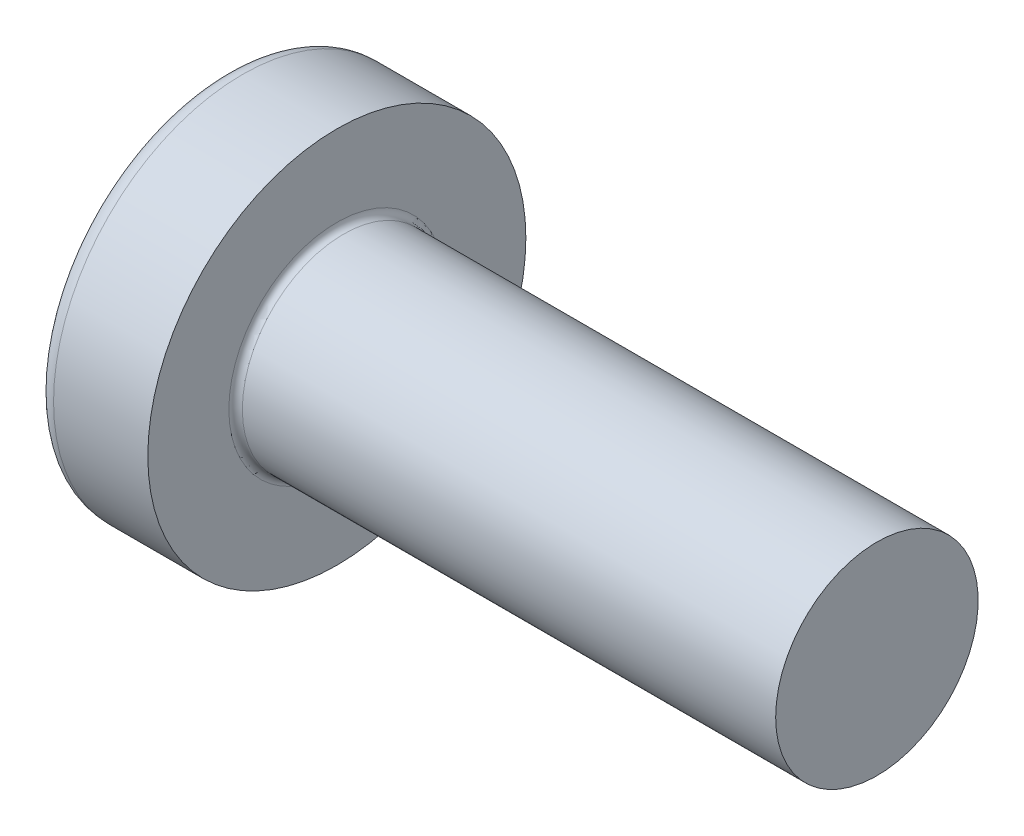
ISO-10303-21;
HEADER;
FILE_DESCRIPTION(('STEP AP214'),'2;1');
FILE_NAME('part.step','',(''),(''),'','','');
FILE_SCHEMA(('AUTOMOTIVE_DESIGN { 1 0 10303 214 1 1 1 1 }'));
ENDSEC;
DATA;
#1=APPLICATION_CONTEXT('core data for automotive mechanical design processes');
#2=APPLICATION_PROTOCOL_DEFINITION('international standard','automotive_design',2000,#1);
#3=PRODUCT_CONTEXT('',#1,'mechanical');
#4=PRODUCT('Part','Part','',(#3));
#5=PRODUCT_RELATED_PRODUCT_CATEGORY('part','',(#4));
#6=PRODUCT_DEFINITION_FORMATION('','',#4);
#7=PRODUCT_DEFINITION_CONTEXT('part definition',#1,'design');
#8=PRODUCT_DEFINITION('design','',#6,#7);
#9=PRODUCT_DEFINITION_SHAPE('','',#8);
#10=(LENGTH_UNIT() NAMED_UNIT(*) SI_UNIT(.MILLI.,.METRE.));
#11=(NAMED_UNIT(*) PLANE_ANGLE_UNIT() SI_UNIT($,.RADIAN.));
#12=(NAMED_UNIT(*) SI_UNIT($,.STERADIAN.) SOLID_ANGLE_UNIT());
#13=UNCERTAINTY_MEASURE_WITH_UNIT(LENGTH_MEASURE(1.E-05),#10,'distance_accuracy_value','');
#14=(GEOMETRIC_REPRESENTATION_CONTEXT(3) GLOBAL_UNCERTAINTY_ASSIGNED_CONTEXT((#13)) GLOBAL_UNIT_ASSIGNED_CONTEXT((#10,
#11,#12)) REPRESENTATION_CONTEXT('',''));
#15=CARTESIAN_POINT('',(0.,0.,0.));
#16=DIRECTION('',(0.,0.,1.));
#17=DIRECTION('',(1.,0.,0.));
#18=AXIS2_PLACEMENT_3D('',#15,#16,#17);
#19=CARTESIAN_POINT('',(-998.069344648895,0.,0.));
#20=DIRECTION('',(-1.,0.,0.));
#21=DIRECTION('',(0.,0.,1.));
#22=AXIS2_PLACEMENT_3D('',#19,#20,#21);
#23=CONICAL_SURFACE('',#22,3077.68353717531,1.25663706143592);
#24=CARTESIAN_POINT('',(1.75,0.,0.));
#25=DIRECTION('',(-1.,0.,0.));
#26=DIRECTION('',(0.,0.,1.));
#27=AXIS2_PLACEMENT_3D('',#24,#25,#26);
#28=CIRCLE('',#27,0.556);
#29=CARTESIAN_POINT('',(1.75,-0.175779377683686,0.52748233181893));
#30=VERTEX_POINT('',#29);
#31=CARTESIAN_POINT('',(1.75,0.175779377683682,0.527482331818932));
#32=VERTEX_POINT('',#31);
#33=EDGE_CURVE('E331',#30,#32,#28,.T.);
#34=ORIENTED_EDGE('',*,*,#33,.T.);
#35=CARTESIAN_POINT('',(1.75,0.,0.));
#36=DIRECTION('',(-1.,0.,0.));
#37=DIRECTION('',(0.,0.,1.));
#38=AXIS2_PLACEMENT_3D('',#35,#36,#37);
#39=CIRCLE('',#38,0.556);
#40=CARTESIAN_POINT('',(1.75,0.369999999999999,0.415013252800439));
#41=VERTEX_POINT('',#40);
#42=EDGE_CURVE('E173',#32,#41,#39,.T.);
#43=ORIENTED_EDGE('',*,*,#42,.T.);
#44=CARTESIAN_POINT('',(1.75,0.,0.));
#45=DIRECTION('',(-1.,0.,0.));
#46=DIRECTION('',(0.,0.,1.));
#47=AXIS2_PLACEMENT_3D('',#44,#45,#46);
#48=CIRCLE('',#47,0.556);
#49=CARTESIAN_POINT('',(1.75,0.415013252800438,0.37));
#50=VERTEX_POINT('',#49);
#51=EDGE_CURVE('E337',#41,#50,#48,.T.);
#52=ORIENTED_EDGE('',*,*,#51,.T.);
#53=CARTESIAN_POINT('',(1.75,0.,0.));
#54=DIRECTION('',(-1.,0.,0.));
#55=DIRECTION('',(0.,0.,1.));
#56=AXIS2_PLACEMENT_3D('',#53,#54,#55);
#57=CIRCLE('',#56,0.556);
#58=CARTESIAN_POINT('',(1.75,0.527482331818932,0.175779377683682));
#59=VERTEX_POINT('',#58);
#60=EDGE_CURVE('E366',#50,#59,#57,.T.);
#61=ORIENTED_EDGE('',*,*,#60,.T.);
#62=CARTESIAN_POINT('',(1.75,0.,0.));
#63=DIRECTION('',(-1.,0.,0.));
#64=DIRECTION('',(0.,0.,1.));
#65=AXIS2_PLACEMENT_3D('',#62,#63,#64);
#66=CIRCLE('',#65,0.556);
#67=CARTESIAN_POINT('',(1.75,0.527482331818932,-0.175779377683682));
#68=VERTEX_POINT('',#67);
#69=EDGE_CURVE('E371',#59,#68,#66,.T.);
#70=ORIENTED_EDGE('',*,*,#69,.T.);
#71=CARTESIAN_POINT('',(1.75,0.,0.));
#72=DIRECTION('',(-1.,0.,0.));
#73=DIRECTION('',(0.,0.,1.));
#74=AXIS2_PLACEMENT_3D('',#71,#72,#73);
#75=CIRCLE('',#74,0.556);
#76=CARTESIAN_POINT('',(1.75,0.415013252800438,-0.37));
#77=VERTEX_POINT('',#76);
#78=EDGE_CURVE('E381',#68,#77,#75,.T.);
#79=ORIENTED_EDGE('',*,*,#78,.T.);
#80=CARTESIAN_POINT('',(1.75,0.,0.));
#81=DIRECTION('',(-1.,0.,0.));
#82=DIRECTION('',(0.,0.,1.));
#83=AXIS2_PLACEMENT_3D('',#80,#81,#82);
#84=CIRCLE('',#83,0.556);
#85=CARTESIAN_POINT('',(1.75,0.370000000000001,-0.415013252800436));
#86=VERTEX_POINT('',#85);
#87=EDGE_CURVE('E323',#77,#86,#84,.T.);
#88=ORIENTED_EDGE('',*,*,#87,.T.);
#89=CARTESIAN_POINT('',(1.75,0.,0.));
#90=DIRECTION('',(-1.,0.,0.));
#91=DIRECTION('',(0.,0.,1.));
#92=AXIS2_PLACEMENT_3D('',#89,#90,#91);
#93=CIRCLE('',#92,0.556);
#94=CARTESIAN_POINT('',(1.75,0.175779377683684,-0.527482331818931));
#95=VERTEX_POINT('',#94);
#96=EDGE_CURVE('E320',#86,#95,#93,.T.);
#97=ORIENTED_EDGE('',*,*,#96,.T.);
#98=CARTESIAN_POINT('',(1.75,0.,0.));
#99=DIRECTION('',(-1.,0.,0.));
#100=DIRECTION('',(0.,0.,1.));
#101=AXIS2_PLACEMENT_3D('',#98,#99,#100);
#102=CIRCLE('',#101,0.556);
#103=CARTESIAN_POINT('',(1.75,-0.17577937768368,-0.527482331818932));
#104=VERTEX_POINT('',#103);
#105=EDGE_CURVE('E11',#95,#104,#102,.T.);
#106=ORIENTED_EDGE('',*,*,#105,.T.);
#107=CARTESIAN_POINT('',(1.75,0.,0.));
#108=DIRECTION('',(-1.,0.,0.));
#109=DIRECTION('',(0.,0.,1.));
#110=AXIS2_PLACEMENT_3D('',#107,#108,#109);
#111=CIRCLE('',#110,0.556);
#112=CARTESIAN_POINT('',(1.75,-0.369999999999999,-0.415013252800439));
#113=VERTEX_POINT('',#112);
#114=EDGE_CURVE('E33',#104,#113,#111,.T.);
#115=ORIENTED_EDGE('',*,*,#114,.T.);
#116=CARTESIAN_POINT('',(1.75,0.,0.));
#117=DIRECTION('',(-1.,0.,0.));
#118=DIRECTION('',(0.,0.,1.));
#119=AXIS2_PLACEMENT_3D('',#116,#117,#118);
#120=CIRCLE('',#119,0.556);
#121=CARTESIAN_POINT('',(1.75,-0.415013252800438,-0.37));
#122=VERTEX_POINT('',#121);
#123=EDGE_CURVE('E185',#113,#122,#120,.T.);
#124=ORIENTED_EDGE('',*,*,#123,.T.);
#125=CARTESIAN_POINT('',(1.75,0.,0.));
#126=DIRECTION('',(-1.,0.,0.));
#127=DIRECTION('',(0.,0.,1.));
#128=AXIS2_PLACEMENT_3D('',#125,#126,#127);
#129=CIRCLE('',#128,0.556);
#130=CARTESIAN_POINT('',(1.75,-0.527482331818932,-0.175779377683681));
#131=VERTEX_POINT('',#130);
#132=EDGE_CURVE('E374',#122,#131,#129,.T.);
#133=ORIENTED_EDGE('',*,*,#132,.T.);
#134=CARTESIAN_POINT('',(1.75,0.,0.));
#135=DIRECTION('',(-1.,0.,0.));
#136=DIRECTION('',(0.,0.,1.));
#137=AXIS2_PLACEMENT_3D('',#134,#135,#136);
#138=CIRCLE('',#137,0.556);
#139=CARTESIAN_POINT('',(1.75,-0.527482331818932,0.175779377683681));
#140=VERTEX_POINT('',#139);
#141=EDGE_CURVE('E348',#131,#140,#138,.T.);
#142=ORIENTED_EDGE('',*,*,#141,.T.);
#143=CARTESIAN_POINT('',(1.75,0.,0.));
#144=DIRECTION('',(-1.,0.,0.));
#145=DIRECTION('',(0.,0.,1.));
#146=AXIS2_PLACEMENT_3D('',#143,#144,#145);
#147=CIRCLE('',#146,0.556);
#148=CARTESIAN_POINT('',(1.75,-0.415013252800438,0.37));
#149=VERTEX_POINT('',#148);
#150=EDGE_CURVE('E345',#140,#149,#147,.T.);
#151=ORIENTED_EDGE('',*,*,#150,.T.);
#152=CARTESIAN_POINT('',(1.75,0.,0.));
#153=DIRECTION('',(-1.,0.,0.));
#154=DIRECTION('',(0.,0.,1.));
#155=AXIS2_PLACEMENT_3D('',#152,#153,#154);
#156=CIRCLE('',#155,0.556);
#157=CARTESIAN_POINT('',(1.75,-0.370000000000001,0.415013252800436));
#158=VERTEX_POINT('',#157);
#159=EDGE_CURVE('E330',#149,#158,#156,.T.);
#160=ORIENTED_EDGE('',*,*,#159,.T.);
#161=CARTESIAN_POINT('',(1.75,0.,0.));
#162=DIRECTION('',(-1.,0.,0.));
#163=DIRECTION('',(0.,0.,1.));
#164=AXIS2_PLACEMENT_3D('',#161,#162,#163);
#165=CIRCLE('',#164,0.556);
#166=EDGE_CURVE('E327',#158,#30,#165,.T.);
#167=ORIENTED_EDGE('',*,*,#166,.T.);
#168=EDGE_LOOP('',(#34,#43,#52,#61,#70,#79,#88,#97,#106,#115,#124,#133,#142,#151,#160,#167));
#169=FACE_BOUND('',#168,.T.);
#170=CARTESIAN_POINT('',(1.93065535110549,0.,0.));
#171=VERTEX_POINT('',#170);
#172=VERTEX_LOOP('',#171);
#173=FACE_BOUND('',#172,.T.);
#174=ADVANCED_FACE('F17',(#169,#173),#23,.F.);
#175=CARTESIAN_POINT('',(1.75,0.,0.));
#176=DIRECTION('',(-1.,0.,0.));
#177=DIRECTION('',(0.,0.,1.));
#178=AXIS2_PLACEMENT_3D('',#175,#176,#177);
#179=CONICAL_SURFACE('',#178,0.556,0.0698131700797659);
#180=CARTESIAN_POINT('',(1.68347170266867,0.,0.560652111736409));
#181=CARTESIAN_POINT('',(1.68347170266867,0.0602907183046768,0.56065211173641));
#182=CARTESIAN_POINT('',(1.70590216018435,0.119555903517962,0.549468700029089));
#183=CARTESIAN_POINT('',(1.75,0.175779377683682,0.527482331818932));
#184=(BOUNDED_CURVE() B_SPLINE_CURVE(3,(#180,#181,#182,#183),.UNSPECIFIED.,.F.,
.F.) B_SPLINE_CURVE_WITH_KNOTS((4,4),(0.,0.369412968615061),
.UNSPECIFIED.) CURVE() GEOMETRIC_REPRESENTATION_ITEM() RATIONAL_B_SPLINE_CURVE((1.,
0.988660132988617,0.988660132988617,1.)) REPRESENTATION_ITEM(''));
#185=CARTESIAN_POINT('',(1.68347170266867,0.,0.560652111736409));
#186=VERTEX_POINT('',#185);
#187=EDGE_CURVE('E469',#186,#32,#184,.T.);
#188=ORIENTED_EDGE('',*,*,#187,.T.);
#189=ORIENTED_EDGE('',*,*,#33,.F.);
#190=CARTESIAN_POINT('',(1.75,-0.175779377683686,0.52748233181893));
#191=CARTESIAN_POINT('',(1.70590216018435,-0.119555903517965,0.549468700029089));
#192=CARTESIAN_POINT('',(1.68347170266867,-0.0602907183046805,0.560652111736409));
#193=CARTESIAN_POINT('',(1.68347170266867,0.,0.560652111736409));
#194=(BOUNDED_CURVE() B_SPLINE_CURVE(3,(#190,#191,#192,#193),.UNSPECIFIED.,.F.,
.F.) B_SPLINE_CURVE_WITH_KNOTS((4,4),(5.91377233856453,6.28318530717959),
.UNSPECIFIED.) CURVE() GEOMETRIC_REPRESENTATION_ITEM() RATIONAL_B_SPLINE_CURVE((1.,
0.988660132988617,0.988660132988617,1.)) REPRESENTATION_ITEM(''));
#195=EDGE_CURVE('E363',#30,#186,#194,.T.);
#196=ORIENTED_EDGE('',*,*,#195,.T.);
#197=EDGE_LOOP('',(#188,#189,#196));
#198=FACE_BOUND('',#197,.T.);
#199=ADVANCED_FACE('F511',(#198),#179,.F.);
#200=CARTESIAN_POINT('',(2.5,0.,0.));
#201=DIRECTION('',(-1.,0.,0.));
#202=DIRECTION('',(0.,0.,1.));
#203=AXIS2_PLACEMENT_3D('',#200,#201,#202);
#204=TOROIDAL_SURFACE('',#203,1.6,0.1);
#205=CARTESIAN_POINT('',(2.5,0.,0.));
#206=DIRECTION('',(1.,0.,0.));
#207=DIRECTION('',(0.,0.,1.));
#208=AXIS2_PLACEMENT_3D('',#205,#206,#207);
#209=CIRCLE('',#208,1.5);
#210=CARTESIAN_POINT('',(2.5,0.,1.5));
#211=VERTEX_POINT('',#210);
#212=EDGE_CURVE('E188',#211,#211,#209,.T.);
#213=ORIENTED_EDGE('',*,*,#212,.F.);
#214=EDGE_LOOP('',(#213));
#215=FACE_BOUND('',#214,.T.);
#216=CARTESIAN_POINT('',(2.4,0.,0.));
#217=DIRECTION('',(-1.,0.,0.));
#218=DIRECTION('',(0.,0.,1.));
#219=AXIS2_PLACEMENT_3D('',#216,#217,#218);
#220=CIRCLE('',#219,1.6);
#221=CARTESIAN_POINT('',(2.4,0.,1.6));
#222=VERTEX_POINT('',#221);
#223=EDGE_CURVE('E193',#222,#222,#220,.T.);
#224=ORIENTED_EDGE('',*,*,#223,.F.);
#225=EDGE_LOOP('',(#224));
#226=FACE_BOUND('',#225,.T.);
#227=ADVANCED_FACE('F567',(#215,#226),#204,.F.);
#228=CARTESIAN_POINT('',(1.00350153259131,0.,0.));
#229=DIRECTION('',(-1.,0.,0.));
#230=DIRECTION('',(0.,0.,1.));
#231=AXIS2_PLACEMENT_3D('',#228,#229,#230);
#232=TOROIDAL_SURFACE('',#231,2.53,0.27);
#233=CARTESIAN_POINT('',(0.775371598933733,0.,0.));
#234=DIRECTION('',(-1.,0.,0.));
#235=DIRECTION('',(0.,0.,1.));
#236=AXIS2_PLACEMENT_3D('',#233,#234,#235);
#237=CIRCLE('',#236,2.67441860465116);
#238=CARTESIAN_POINT('',(0.775371598933733,0.,2.67441860465116));
#239=VERTEX_POINT('',#238);
#240=EDGE_CURVE('E458',#239,#239,#237,.T.);
#241=ORIENTED_EDGE('',*,*,#240,.F.);
#242=EDGE_LOOP('',(#241));
#243=FACE_BOUND('',#242,.T.);
#244=CARTESIAN_POINT('',(1.00350153259131,0.,0.));
#245=DIRECTION('',(-1.,0.,0.));
#246=DIRECTION('',(0.,0.,1.));
#247=AXIS2_PLACEMENT_3D('',#244,#245,#246);
#248=CIRCLE('',#247,2.8);
#249=CARTESIAN_POINT('',(1.00350153259131,0.,2.8));
#250=VERTEX_POINT('',#249);
#251=EDGE_CURVE('E465',#250,#250,#248,.T.);
#252=ORIENTED_EDGE('',*,*,#251,.T.);
#253=EDGE_LOOP('',(#252));
#254=FACE_BOUND('',#253,.T.);
#255=ADVANCED_FACE('F572',(#243,#254),#232,.T.);
#256=CARTESIAN_POINT('',(-25.4,0.,0.));
#257=DIRECTION('',(-1.,0.,0.));
#258=DIRECTION('',(0.,0.,1.));
#259=AXIS2_PLACEMENT_3D('',#256,#257,#258);
#260=CYLINDRICAL_SURFACE('',#259,2.8);
#261=ORIENTED_EDGE('',*,*,#251,.F.);
#262=EDGE_LOOP('',(#261));
#263=FACE_BOUND('',#262,.T.);
#264=CARTESIAN_POINT('',(2.4,0.,0.));
#265=DIRECTION('',(-1.,0.,0.));
#266=DIRECTION('',(0.,0.,1.));
#267=AXIS2_PLACEMENT_3D('',#264,#265,#266);
#268=CIRCLE('',#267,2.8);
#269=CARTESIAN_POINT('',(2.4,0.,2.8));
#270=VERTEX_POINT('',#269);
#271=EDGE_CURVE('E462',#270,#270,#268,.T.);
#272=ORIENTED_EDGE('',*,*,#271,.T.);
#273=EDGE_LOOP('',(#272));
#274=FACE_BOUND('',#273,.T.);
#275=ADVANCED_FACE('F576',(#263,#274),#260,.T.);
#276=CARTESIAN_POINT('',(-25.4,0.,0.));
#277=DIRECTION('',(-1.,0.,0.));
#278=DIRECTION('',(0.,0.,1.));
#279=AXIS2_PLACEMENT_3D('',#276,#277,#278);
#280=CYLINDRICAL_SURFACE('',#279,1.5);
#281=ORIENTED_EDGE('',*,*,#212,.T.);
#282=EDGE_LOOP('',(#281));
#283=FACE_BOUND('',#282,.T.);
#284=CARTESIAN_POINT('',(10.4,0.,0.));
#285=DIRECTION('',(-1.,0.,0.));
#286=DIRECTION('',(0.,0.,1.));
#287=AXIS2_PLACEMENT_3D('',#284,#285,#286);
#288=CIRCLE('',#287,1.5);
#289=CARTESIAN_POINT('',(10.4,0.,1.5));
#290=VERTEX_POINT('',#289);
#291=EDGE_CURVE('E459',#290,#290,#288,.T.);
#292=ORIENTED_EDGE('',*,*,#291,.T.);
#293=EDGE_LOOP('',(#292));
#294=FACE_BOUND('',#293,.T.);
#295=ADVANCED_FACE('F579',(#283,#294),#280,.T.);
#296=CARTESIAN_POINT('',(5.,0.,0.));
#297=DIRECTION('',(0.,0.,-1.));
#298=DIRECTION('',(0.,1.,0.));
#299=AXIS2_PLACEMENT_3D('',#296,#297,#298);
#300=SPHERICAL_SURFACE('',#299,5.);
#301=CARTESIAN_POINT('',(4.56358262530798,-0.87531798330592,0.));
#302=DIRECTION('',(0.446197753347436,0.894934391398443,0.));
#303=DIRECTION('',(-0.894934391398443,0.446197753347436,0.));
#304=AXIS2_PLACEMENT_3D('',#301,#302,#303);
#305=CIRCLE('',#304,4.90340272700175);
#306=CARTESIAN_POINT('',(0.18786973422864,1.30633162146802,-0.37));
#307=VERTEX_POINT('',#306);
#308=CARTESIAN_POINT('',(0.18786973422864,1.30633162146802,0.37));
#309=VERTEX_POINT('',#308);
#310=EDGE_CURVE('E452',#307,#309,#305,.T.);
#311=ORIENTED_EDGE('',*,*,#310,.T.);
#312=CARTESIAN_POINT('',(5.,0.,0.37));
#313=DIRECTION('',(0.,0.,-1.));
#314=DIRECTION('',(0.,1.,0.));
#315=AXIS2_PLACEMENT_3D('',#312,#313,#314);
#316=CIRCLE('',#315,4.98629120689917);
#317=CARTESIAN_POINT('',(0.0457951200896417,0.564760133040916,0.37));
#318=VERTEX_POINT('',#317);
#319=EDGE_CURVE('E246',#318,#309,#316,.T.);
#320=ORIENTED_EDGE('',*,*,#319,.F.);
#321=CARTESIAN_POINT('',(0.0457951200896417,0.,0.));
#322=DIRECTION('',(-1.,0.,0.));
#323=DIRECTION('',(0.,0.,-1.));
#324=AXIS2_PLACEMENT_3D('',#321,#322,#323);
#325=CIRCLE('',#324,0.675169614150692);
#326=CARTESIAN_POINT('',(0.0457951200896413,0.369999999999998,0.564760133040918));
#327=VERTEX_POINT('',#326);
#328=EDGE_CURVE('E360',#327,#318,#325,.T.);
#329=ORIENTED_EDGE('',*,*,#328,.F.);
#330=CARTESIAN_POINT('',(5.,0.37,0.));
#331=DIRECTION('',(0.,-1.,0.));
#332=DIRECTION('',(0.,0.,-1.));
#333=AXIS2_PLACEMENT_3D('',#330,#331,#332);
#334=CIRCLE('',#333,4.98629120689917);
#335=CARTESIAN_POINT('',(0.18786973422864,0.369999999999995,1.30633162146802));
#336=VERTEX_POINT('',#335);
#337=EDGE_CURVE('E271',#336,#327,#334,.T.);
#338=ORIENTED_EDGE('',*,*,#337,.F.);
#339=CARTESIAN_POINT('',(4.56358262530798,0.,-0.87531798330592));
#340=DIRECTION('',(0.446197753347436,0.,0.894934391398443));
#341=DIRECTION('',(0.894934391398443,0.,-0.446197753347436));
#342=AXIS2_PLACEMENT_3D('',#339,#340,#341);
#343=CIRCLE('',#342,4.90340272700175);
#344=CARTESIAN_POINT('',(0.18786973422864,-0.370000000000005,1.30633162146802));
#345=VERTEX_POINT('',#344);
#346=EDGE_CURVE('E387',#336,#345,#343,.T.);
#347=ORIENTED_EDGE('',*,*,#346,.T.);
#348=CARTESIAN_POINT('',(5.,-0.37,0.));
#349=DIRECTION('',(0.,1.,0.));
#350=DIRECTION('',(0.,0.,1.));
#351=AXIS2_PLACEMENT_3D('',#348,#349,#350);
#352=CIRCLE('',#351,4.98629120689917);
#353=CARTESIAN_POINT('',(0.0457951200896417,-0.370000000000002,0.564760133040915));
#354=VERTEX_POINT('',#353);
#355=EDGE_CURVE('E324',#354,#345,#352,.T.);
#356=ORIENTED_EDGE('',*,*,#355,.F.);
#357=CARTESIAN_POINT('',(0.0457951200896417,0.,0.));
#358=DIRECTION('',(-1.,0.,0.));
#359=DIRECTION('',(0.,0.,-1.));
#360=AXIS2_PLACEMENT_3D('',#357,#358,#359);
#361=CIRCLE('',#360,0.675169614150692);
#362=CARTESIAN_POINT('',(0.0457951200896417,-0.564760133040916,0.37));
#363=VERTEX_POINT('',#362);
#364=EDGE_CURVE('E355',#363,#354,#361,.T.);
#365=ORIENTED_EDGE('',*,*,#364,.F.);
#366=CARTESIAN_POINT('',(5.,0.,0.37));
#367=DIRECTION('',(0.,0.,-1.));
#368=DIRECTION('',(0.,1.,0.));
#369=AXIS2_PLACEMENT_3D('',#366,#367,#368);
#370=CIRCLE('',#369,4.98629120689917);
#371=CARTESIAN_POINT('',(0.187869734228639,-1.30633162146802,0.37));
#372=VERTEX_POINT('',#371);
#373=EDGE_CURVE('E351',#372,#363,#370,.T.);
#374=ORIENTED_EDGE('',*,*,#373,.F.);
#375=CARTESIAN_POINT('',(4.56358262530798,0.875317983305919,0.));
#376=DIRECTION('',(0.446197753347436,-0.894934391398443,0.));
#377=DIRECTION('',(0.894934391398443,0.446197753347436,0.));
#378=AXIS2_PLACEMENT_3D('',#375,#376,#377);
#379=CIRCLE('',#378,4.90340272700175);
#380=CARTESIAN_POINT('',(0.18786973422864,-1.30633162146802,-0.37));
#381=VERTEX_POINT('',#380);
#382=EDGE_CURVE('E456',#372,#381,#379,.T.);
#383=ORIENTED_EDGE('',*,*,#382,.T.);
#384=CARTESIAN_POINT('',(5.,0.,-0.37));
#385=DIRECTION('',(0.,0.,1.));
#386=DIRECTION('',(1.,0.,0.));
#387=AXIS2_PLACEMENT_3D('',#384,#385,#386);
#388=CIRCLE('',#387,4.98629120689917);
#389=CARTESIAN_POINT('',(0.0457951200896413,-0.564760133040917,-0.37));
#390=VERTEX_POINT('',#389);
#391=EDGE_CURVE('E167',#390,#381,#388,.T.);
#392=ORIENTED_EDGE('',*,*,#391,.F.);
#393=CARTESIAN_POINT('',(0.0457951200896417,0.,0.));
#394=DIRECTION('',(-1.,0.,0.));
#395=DIRECTION('',(0.,0.,-1.));
#396=AXIS2_PLACEMENT_3D('',#393,#394,#395);
#397=CIRCLE('',#396,0.675169614150692);
#398=CARTESIAN_POINT('',(0.0457951200896417,-0.369999999999998,-0.564760133040918));
#399=VERTEX_POINT('',#398);
#400=EDGE_CURVE('E159',#399,#390,#397,.T.);
#401=ORIENTED_EDGE('',*,*,#400,.F.);
#402=CARTESIAN_POINT('',(5.,-0.37,0.));
#403=DIRECTION('',(0.,1.,0.));
#404=DIRECTION('',(0.,0.,1.));
#405=AXIS2_PLACEMENT_3D('',#402,#403,#404);
#406=CIRCLE('',#405,4.98629120689917);
#407=CARTESIAN_POINT('',(0.187869734228639,-0.369999999999995,-1.30633162146802));
#408=VERTEX_POINT('',#407);
#409=EDGE_CURVE('E164',#408,#399,#406,.T.);
#410=ORIENTED_EDGE('',*,*,#409,.F.);
#411=CARTESIAN_POINT('',(4.56358262530798,0.,0.875317983305919));
#412=DIRECTION('',(0.446197753347436,0.,-0.894934391398443));
#413=DIRECTION('',(-0.894934391398443,0.,-0.446197753347436));
#414=AXIS2_PLACEMENT_3D('',#411,#412,#413);
#415=CIRCLE('',#414,4.90340272700175);
#416=CARTESIAN_POINT('',(0.18786973422864,0.370000000000005,-1.30633162146802));
#417=VERTEX_POINT('',#416);
#418=EDGE_CURVE('E454',#408,#417,#415,.T.);
#419=ORIENTED_EDGE('',*,*,#418,.T.);
#420=CARTESIAN_POINT('',(5.,0.37,0.));
#421=DIRECTION('',(0.,-1.,0.));
#422=DIRECTION('',(0.,0.,-1.));
#423=AXIS2_PLACEMENT_3D('',#420,#421,#422);
#424=CIRCLE('',#423,4.98629120689917);
#425=CARTESIAN_POINT('',(0.0457951200896417,0.370000000000002,-0.564760133040915));
#426=VERTEX_POINT('',#425);
#427=EDGE_CURVE('E312',#426,#417,#424,.T.);
#428=ORIENTED_EDGE('',*,*,#427,.F.);
#429=CARTESIAN_POINT('',(0.0457951200896417,0.,0.));
#430=DIRECTION('',(-1.,0.,0.));
#431=DIRECTION('',(0.,0.,-1.));
#432=AXIS2_PLACEMENT_3D('',#429,#430,#431);
#433=CIRCLE('',#432,0.675169614150692);
#434=CARTESIAN_POINT('',(0.0457951200896413,0.564760133040917,-0.37));
#435=VERTEX_POINT('',#434);
#436=EDGE_CURVE('E172',#435,#426,#433,.T.);
#437=ORIENTED_EDGE('',*,*,#436,.F.);
#438=CARTESIAN_POINT('',(5.,0.,-0.37));
#439=DIRECTION('',(0.,0.,1.));
#440=DIRECTION('',(1.,0.,0.));
#441=AXIS2_PLACEMENT_3D('',#438,#439,#440);
#442=CIRCLE('',#441,4.98629120689917);
#443=EDGE_CURVE('E206',#307,#435,#442,.T.);
#444=ORIENTED_EDGE('',*,*,#443,.F.);
#445=EDGE_LOOP('',(#311,#320,#329,#338,#347,#356,#365,#374,#383,#392,#401,#410,#419,#428,#437,#444));
#446=FACE_BOUND('',#445,.T.);
#447=ORIENTED_EDGE('',*,*,#240,.T.);
#448=EDGE_LOOP('',(#447));
#449=FACE_BOUND('',#448,.T.);
#450=ADVANCED_FACE('F161',(#446,#449),#300,.T.);
#451=CARTESIAN_POINT('',(1.75,0.527482331818931,-0.37));
#452=DIRECTION('',(0.,0.,1.));
#453=DIRECTION('',(1.,0.,0.));
#454=AXIS2_PLACEMENT_3D('',#451,#452,#453);
#455=PLANE('',#454);
#456=ORIENTED_EDGE('',*,*,#443,.T.);
#457=CARTESIAN_POINT('',(0.0457951200896419,0.564760133040917,-0.37));
#458=CARTESIAN_POINT('',(0.255445140282625,0.547215941551856,-0.37));
#459=CARTESIAN_POINT('',(0.465078549071387,0.529461606552609,-0.37));
#460=CARTESIAN_POINT('',(0.884285867410568,0.493290154582279,-0.37));
#461=CARTESIAN_POINT('',(1.09385977755337,0.474873044461165,-0.37));
#462=CARTESIAN_POINT('',(1.37783894535666,0.449298740081308,-0.37));
#463=CARTESIAN_POINT('',(1.45227978378134,0.442537199862522,-0.37));
#464=CARTESIAN_POINT('',(1.60114945894844,0.428880376884767,-0.37));
#465=CARTESIAN_POINT('',(1.67557829564619,0.421985093638948,-0.37));
#466=CARTESIAN_POINT('',(1.75,0.415013252800489,-0.37));
#467=B_SPLINE_CURVE_WITH_KNOTS('',3,(#457,#458,#459,#460,#461,#462,#463,#464,#465,#466),
.UNSPECIFIED.,.F.,.F.,(4,2,2,2,4),(0.,0.631149918810773,1.26229331638151,1.48653506176444,
1.71077762358416),.UNSPECIFIED.);
#468=EDGE_CURVE('E198',#435,#77,#467,.T.);
#469=ORIENTED_EDGE('',*,*,#468,.T.);
#470=DIRECTION('',(0.,1.,0.));
#471=VECTOR('',#470,1.);
#472=CARTESIAN_POINT('',(1.75,-0.527482331818932,-0.37));
#473=LINE('',#472,#471);
#474=CARTESIAN_POINT('',(1.75,0.527482331818931,-0.37));
#475=VERTEX_POINT('',#474);
#476=EDGE_CURVE('E207',#77,#475,#473,.T.);
#477=ORIENTED_EDGE('',*,*,#476,.T.);
#478=DIRECTION('',(0.894934391398443,-0.446197753347436,0.));
#479=VECTOR('',#478,1.);
#480=CARTESIAN_POINT('',(0.,1.4,-0.37));
#481=LINE('',#480,#479);
#482=EDGE_CURVE('E344',#307,#475,#481,.T.);
#483=ORIENTED_EDGE('',*,*,#482,.F.);
#484=EDGE_LOOP('',(#456,#469,#477,#483));
#485=FACE_BOUND('',#484,.T.);
#486=ADVANCED_FACE('F218',(#485),#455,.T.);
#487=CARTESIAN_POINT('',(1.75,0.527482331818931,-0.37));
#488=DIRECTION('',(0.,0.,1.));
#489=DIRECTION('',(1.,0.,0.));
#490=AXIS2_PLACEMENT_3D('',#487,#488,#489);
#491=PLANE('',#490);
#492=DIRECTION('',(0.,1.,0.));
#493=VECTOR('',#492,1.);
#494=CARTESIAN_POINT('',(1.75,-0.527482331818932,-0.37));
#495=LINE('',#494,#493);
#496=CARTESIAN_POINT('',(1.75,-0.527482331818932,-0.37));
#497=VERTEX_POINT('',#496);
#498=EDGE_CURVE('E377',#497,#122,#495,.T.);
#499=ORIENTED_EDGE('',*,*,#498,.T.);
#500=CARTESIAN_POINT('',(1.75,-0.415013252800438,-0.37));
#501=CARTESIAN_POINT('',(1.57750313528675,-0.431158401719318,-0.37));
#502=CARTESIAN_POINT('',(1.40497097416522,-0.446919622844841,-0.37));
#503=CARTESIAN_POINT('',(1.0598533896683,-0.477835186404406,-0.37));
#504=CARTESIAN_POINT('',(0.887267966667615,-0.492989533014186,-0.37));
#505=CARTESIAN_POINT('',(0.603200028720877,-0.517563398998859,-0.37));
#506=CARTESIAN_POINT('',(0.491728679642336,-0.527112830211551,-0.37));
#507=CARTESIAN_POINT('',(0.268771821460354,-0.546050865477643,-0.37));
#508=CARTESIAN_POINT('',(0.157286312296861,-0.555439468824354,-0.37));
#509=CARTESIAN_POINT('',(0.0457951200896438,-0.564760133040937,-0.37));
#510=B_SPLINE_CURVE_WITH_KNOTS('',3,(#500,#501,#502,#503,#504,#505,#506,#507,#508,#509),
.UNSPECIFIED.,.F.,.F.,(4,2,2,2,4),(0.,0.519751028859639,1.03949848083807,1.37513731239204,
1.71077761838857),.UNSPECIFIED.);
#511=EDGE_CURVE('E208',#122,#390,#510,.T.);
#512=ORIENTED_EDGE('',*,*,#511,.T.);
#513=ORIENTED_EDGE('',*,*,#391,.T.);
#514=DIRECTION('',(0.894934391398443,0.446197753347436,0.));
#515=VECTOR('',#514,1.);
#516=CARTESIAN_POINT('',(0.,-1.4,-0.37));
#517=LINE('',#516,#515);
#518=EDGE_CURVE('E369',#381,#497,#517,.T.);
#519=ORIENTED_EDGE('',*,*,#518,.T.);
#520=EDGE_LOOP('',(#499,#512,#513,#519));
#521=FACE_BOUND('',#520,.T.);
#522=ADVANCED_FACE('F222',(#521),#491,.T.);
#523=CARTESIAN_POINT('',(1.75,-0.527482331818932,0.37));
#524=DIRECTION('',(0.,0.,-1.));
#525=DIRECTION('',(0.,1.,0.));
#526=AXIS2_PLACEMENT_3D('',#523,#524,#525);
#527=PLANE('',#526);
#528=DIRECTION('',(0.,-1.,0.));
#529=VECTOR('',#528,1.);
#530=CARTESIAN_POINT('',(1.75,0.527482331818931,0.37));
#531=LINE('',#530,#529);
#532=CARTESIAN_POINT('',(1.75,0.527482331818931,0.37));
#533=VERTEX_POINT('',#532);
#534=EDGE_CURVE('E245',#533,#50,#531,.T.);
#535=ORIENTED_EDGE('',*,*,#534,.T.);
#536=CARTESIAN_POINT('',(1.75,0.415013252800438,0.37));
#537=CARTESIAN_POINT('',(1.57750313528675,0.431158401719318,0.37));
#538=CARTESIAN_POINT('',(1.40497097416522,0.446919622844841,0.37));
#539=CARTESIAN_POINT('',(1.0598533896683,0.477835186404406,0.37));
#540=CARTESIAN_POINT('',(0.887267966667616,0.492989533014186,0.37));
#541=CARTESIAN_POINT('',(0.603200028720877,0.517563398998859,0.37));
#542=CARTESIAN_POINT('',(0.491728679642336,0.527112830211551,0.37));
#543=CARTESIAN_POINT('',(0.268771821460354,0.546050865477643,0.37));
#544=CARTESIAN_POINT('',(0.157286312296861,0.555439468824354,0.37));
#545=CARTESIAN_POINT('',(0.0457951200896435,0.564760133040937,0.37));
#546=B_SPLINE_CURVE_WITH_KNOTS('',3,(#536,#537,#538,#539,#540,#541,#542,#543,#544,#545),
.UNSPECIFIED.,.F.,.F.,(4,2,2,2,4),(0.,0.519751028859639,1.03949848083807,1.37513731239204,
1.71077761838857),.UNSPECIFIED.);
#547=EDGE_CURVE('E237',#50,#318,#546,.T.);
#548=ORIENTED_EDGE('',*,*,#547,.T.);
#549=ORIENTED_EDGE('',*,*,#319,.T.);
#550=DIRECTION('',(0.894934391398443,-0.446197753347436,0.));
#551=VECTOR('',#550,1.);
#552=CARTESIAN_POINT('',(0.,1.4,0.37));
#553=LINE('',#552,#551);
#554=EDGE_CURVE('E354',#309,#533,#553,.T.);
#555=ORIENTED_EDGE('',*,*,#554,.T.);
#556=EDGE_LOOP('',(#535,#548,#549,#555));
#557=FACE_BOUND('',#556,.T.);
#558=ADVANCED_FACE('F228',(#557),#527,.T.);
#559=CARTESIAN_POINT('',(1.75,-0.527482331818932,0.37));
#560=DIRECTION('',(0.,0.,-1.));
#561=DIRECTION('',(0.,1.,0.));
#562=AXIS2_PLACEMENT_3D('',#559,#560,#561);
#563=PLANE('',#562);
#564=ORIENTED_EDGE('',*,*,#373,.T.);
#565=CARTESIAN_POINT('',(0.0457951200896419,-0.564760133040917,0.37));
#566=CARTESIAN_POINT('',(0.255445140282625,-0.547215941551857,0.37));
#567=CARTESIAN_POINT('',(0.465078549071387,-0.529461606552609,0.37));
#568=CARTESIAN_POINT('',(0.884285867410568,-0.493290154582279,0.37));
#569=CARTESIAN_POINT('',(1.09385977755337,-0.474873044461165,0.37));
#570=CARTESIAN_POINT('',(1.37783894535666,-0.449298740081308,0.37));
#571=CARTESIAN_POINT('',(1.45227978378134,-0.442537199862522,0.37));
#572=CARTESIAN_POINT('',(1.60114945894844,-0.428880376884768,0.37));
#573=CARTESIAN_POINT('',(1.67557829564619,-0.421985093638949,0.37));
#574=CARTESIAN_POINT('',(1.75,-0.415013252800489,0.37));
#575=B_SPLINE_CURVE_WITH_KNOTS('',3,(#565,#566,#567,#568,#569,#570,#571,#572,#573,#574),
.UNSPECIFIED.,.F.,.F.,(4,2,2,2,4),(0.,0.631149918810773,1.26229331638151,1.48653506176444,
1.71077762358416),.UNSPECIFIED.);
#576=EDGE_CURVE('E247',#363,#149,#575,.T.);
#577=ORIENTED_EDGE('',*,*,#576,.T.);
#578=DIRECTION('',(0.,-1.,0.));
#579=VECTOR('',#578,1.);
#580=CARTESIAN_POINT('',(1.75,0.527482331818931,0.37));
#581=LINE('',#580,#579);
#582=CARTESIAN_POINT('',(1.75,-0.527482331818932,0.37));
#583=VERTEX_POINT('',#582);
#584=EDGE_CURVE('E341',#149,#583,#581,.T.);
#585=ORIENTED_EDGE('',*,*,#584,.T.);
#586=DIRECTION('',(0.894934391398443,0.446197753347436,0.));
#587=VECTOR('',#586,1.);
#588=CARTESIAN_POINT('',(0.,-1.4,0.37));
#589=LINE('',#588,#587);
#590=EDGE_CURVE('E423',#372,#583,#589,.T.);
#591=ORIENTED_EDGE('',*,*,#590,.F.);
#592=EDGE_LOOP('',(#564,#577,#585,#591));
#593=FACE_BOUND('',#592,.T.);
#594=ADVANCED_FACE('F233',(#593),#563,.T.);
#595=CARTESIAN_POINT('',(1.75,0.527482331818931,0.37));
#596=DIRECTION('',(0.446197753347436,0.894934391398443,0.));
#597=DIRECTION('',(-0.894934391398443,0.446197753347436,0.));
#598=AXIS2_PLACEMENT_3D('',#595,#596,#597);
#599=PLANE('',#598);
#600=CARTESIAN_POINT('',(1.75,0.527482331818932,0.175779377683682));
#601=CARTESIAN_POINT('',(1.6602512961887,0.572229377402766,0.0613523683055392));
#602=CARTESIAN_POINT('',(1.6602512961887,0.572229377402766,-0.061352368305539));
#603=CARTESIAN_POINT('',(1.75,0.527482331818932,-0.175779377683682));
#604=(BOUNDED_CURVE() B_SPLINE_CURVE(3,(#600,#601,#602,#603),.UNSPECIFIED.,.F.,
.F.) B_SPLINE_CURVE_WITH_KNOTS((4,4),(5.91377233856453,6.65259827579464),
.UNSPECIFIED.) CURVE() GEOMETRIC_REPRESENTATION_ITEM() RATIONAL_B_SPLINE_CURVE((1.,
0.955026309705975,0.955026309705975,1.)) REPRESENTATION_ITEM(''));
#605=EDGE_CURVE('E403',#59,#68,#604,.T.);
#606=ORIENTED_EDGE('',*,*,#605,.F.);
#607=DIRECTION('',(0.,0.,-1.));
#608=VECTOR('',#607,1.);
#609=CARTESIAN_POINT('',(1.75,0.527482331818931,0.37));
#610=LINE('',#609,#608);
#611=EDGE_CURVE('E340',#533,#59,#610,.T.);
#612=ORIENTED_EDGE('',*,*,#611,.F.);
#613=ORIENTED_EDGE('',*,*,#554,.F.);
#614=ORIENTED_EDGE('',*,*,#310,.F.);
#615=ORIENTED_EDGE('',*,*,#482,.T.);
#616=DIRECTION('',(0.,0.,-1.));
#617=VECTOR('',#616,1.);
#618=CARTESIAN_POINT('',(1.75,0.527482331818931,0.37));
#619=LINE('',#618,#617);
#620=EDGE_CURVE('E418',#68,#475,#619,.T.);
#621=ORIENTED_EDGE('',*,*,#620,.F.);
#622=EDGE_LOOP('',(#606,#612,#613,#614,#615,#621));
#623=FACE_BOUND('',#622,.T.);
#624=ADVANCED_FACE('F527',(#623),#599,.F.);
#625=CARTESIAN_POINT('',(0.,-1.4,-0.37));
#626=DIRECTION('',(0.446197753347436,-0.894934391398443,0.));
#627=DIRECTION('',(0.894934391398443,0.446197753347436,0.));
#628=AXIS2_PLACEMENT_3D('',#625,#626,#627);
#629=PLANE('',#628);
#630=CARTESIAN_POINT('',(1.75,-0.527482331818932,-0.175779377683681));
#631=CARTESIAN_POINT('',(1.6602512961887,-0.572229377402766,-0.0613523683055387));
#632=CARTESIAN_POINT('',(1.6602512961887,-0.572229377402766,0.0613523683055385));
#633=CARTESIAN_POINT('',(1.75,-0.527482331818932,0.175779377683681));
#634=(BOUNDED_CURVE() B_SPLINE_CURVE(3,(#630,#631,#632,#633),.UNSPECIFIED.,.F.,
.F.) B_SPLINE_CURVE_WITH_KNOTS((4,4),(5.91377233856453,6.65259827579464),
.UNSPECIFIED.) CURVE() GEOMETRIC_REPRESENTATION_ITEM() RATIONAL_B_SPLINE_CURVE((1.,
0.955026309705976,0.955026309705976,1.)) REPRESENTATION_ITEM(''));
#635=EDGE_CURVE('E362',#131,#140,#634,.T.);
#636=ORIENTED_EDGE('',*,*,#635,.F.);
#637=DIRECTION('',(0.,0.,1.));
#638=VECTOR('',#637,1.);
#639=CARTESIAN_POINT('',(1.75,-0.527482331818932,-0.37));
#640=LINE('',#639,#638);
#641=EDGE_CURVE('E420',#497,#131,#640,.T.);
#642=ORIENTED_EDGE('',*,*,#641,.F.);
#643=ORIENTED_EDGE('',*,*,#518,.F.);
#644=ORIENTED_EDGE('',*,*,#382,.F.);
#645=ORIENTED_EDGE('',*,*,#590,.T.);
#646=DIRECTION('',(0.,0.,1.));
#647=VECTOR('',#646,1.);
#648=CARTESIAN_POINT('',(1.75,-0.527482331818932,-0.37));
#649=LINE('',#648,#647);
#650=EDGE_CURVE('E424',#140,#583,#649,.T.);
#651=ORIENTED_EDGE('',*,*,#650,.F.);
#652=EDGE_LOOP('',(#636,#642,#643,#644,#645,#651));
#653=FACE_BOUND('',#652,.T.);
#654=ADVANCED_FACE('F490',(#653),#629,.F.);
#655=CARTESIAN_POINT('',(1.75,0.527482331818931,-0.37));
#656=DIRECTION('',(-1.,0.,0.));
#657=DIRECTION('',(0.,0.,1.));
#658=AXIS2_PLACEMENT_3D('',#655,#656,#657);
#659=PLANE('',#658);
#660=DIRECTION('',(0.,1.,0.));
#661=VECTOR('',#660,1.);
#662=CARTESIAN_POINT('',(1.75,-0.370000000000002,0.52748233181893));
#663=LINE('',#662,#661);
#664=CARTESIAN_POINT('',(1.75,-0.370000000000002,0.52748233181893));
#665=VERTEX_POINT('',#664);
#666=EDGE_CURVE('E421',#665,#30,#663,.T.);
#667=ORIENTED_EDGE('',*,*,#666,.T.);
#668=ORIENTED_EDGE('',*,*,#166,.F.);
#669=DIRECTION('',(0.,0.,-1.));
#670=VECTOR('',#669,1.);
#671=CARTESIAN_POINT('',(1.75,-0.370000000000002,0.52748233181893));
#672=LINE('',#671,#670);
#673=EDGE_CURVE('E332',#665,#158,#672,.T.);
#674=ORIENTED_EDGE('',*,*,#673,.F.);
#675=EDGE_LOOP('',(#667,#668,#674));
#676=FACE_BOUND('',#675,.T.);
#677=ADVANCED_FACE('F551',(#676),#659,.T.);
#678=CARTESIAN_POINT('',(1.75,0.527482331818931,-0.37));
#679=DIRECTION('',(-1.,0.,0.));
#680=DIRECTION('',(0.,0.,1.));
#681=AXIS2_PLACEMENT_3D('',#678,#679,#680);
#682=PLANE('',#681);
#683=ORIENTED_EDGE('',*,*,#584,.F.);
#684=ORIENTED_EDGE('',*,*,#150,.F.);
#685=ORIENTED_EDGE('',*,*,#650,.T.);
#686=EDGE_LOOP('',(#683,#684,#685));
#687=FACE_BOUND('',#686,.T.);
#688=ADVANCED_FACE('F494',(#687),#682,.T.);
#689=CARTESIAN_POINT('',(1.75,0.527482331818931,-0.37));
#690=DIRECTION('',(-1.,0.,0.));
#691=DIRECTION('',(0.,0.,1.));
#692=AXIS2_PLACEMENT_3D('',#689,#690,#691);
#693=PLANE('',#692);
#694=ORIENTED_EDGE('',*,*,#641,.T.);
#695=ORIENTED_EDGE('',*,*,#132,.F.);
#696=ORIENTED_EDGE('',*,*,#498,.F.);
#697=EDGE_LOOP('',(#694,#695,#696));
#698=FACE_BOUND('',#697,.T.);
#699=ADVANCED_FACE('F559',(#698),#693,.T.);
#700=CARTESIAN_POINT('',(1.75,0.527482331818931,-0.37));
#701=DIRECTION('',(-1.,0.,0.));
#702=DIRECTION('',(0.,0.,1.));
#703=AXIS2_PLACEMENT_3D('',#700,#701,#702);
#704=PLANE('',#703);
#705=DIRECTION('',(0.,0.,-1.));
#706=VECTOR('',#705,1.);
#707=CARTESIAN_POINT('',(1.75,-0.370000000000002,0.52748233181893));
#708=LINE('',#707,#706);
#709=CARTESIAN_POINT('',(1.75,-0.369999999999998,-0.527482331818933));
#710=VERTEX_POINT('',#709);
#711=EDGE_CURVE('E187',#113,#710,#708,.T.);
#712=ORIENTED_EDGE('',*,*,#711,.F.);
#713=ORIENTED_EDGE('',*,*,#114,.F.);
#714=DIRECTION('',(0.,-1.,0.));
#715=VECTOR('',#714,1.);
#716=CARTESIAN_POINT('',(1.75,0.370000000000002,-0.52748233181893));
#717=LINE('',#716,#715);
#718=EDGE_CURVE('E417',#104,#710,#717,.T.);
#719=ORIENTED_EDGE('',*,*,#718,.T.);
#720=EDGE_LOOP('',(#712,#713,#719));
#721=FACE_BOUND('',#720,.T.);
#722=ADVANCED_FACE('F547',(#721),#704,.T.);
#723=CARTESIAN_POINT('',(1.75,0.527482331818931,-0.37));
#724=DIRECTION('',(-1.,0.,0.));
#725=DIRECTION('',(0.,0.,1.));
#726=AXIS2_PLACEMENT_3D('',#723,#724,#725);
#727=PLANE('',#726);
#728=DIRECTION('',(0.,-1.,0.));
#729=VECTOR('',#728,1.);
#730=CARTESIAN_POINT('',(1.75,0.370000000000002,-0.52748233181893));
#731=LINE('',#730,#729);
#732=CARTESIAN_POINT('',(1.75,0.370000000000002,-0.52748233181893));
#733=VERTEX_POINT('',#732);
#734=EDGE_CURVE('E414',#733,#95,#731,.T.);
#735=ORIENTED_EDGE('',*,*,#734,.T.);
#736=ORIENTED_EDGE('',*,*,#96,.F.);
#737=DIRECTION('',(0.,0.,1.));
#738=VECTOR('',#737,1.);
#739=CARTESIAN_POINT('',(1.75,0.370000000000002,-0.52748233181893));
#740=LINE('',#739,#738);
#741=EDGE_CURVE('E311',#733,#86,#740,.T.);
#742=ORIENTED_EDGE('',*,*,#741,.F.);
#743=EDGE_LOOP('',(#735,#736,#742));
#744=FACE_BOUND('',#743,.T.);
#745=ADVANCED_FACE('F542',(#744),#727,.T.);
#746=CARTESIAN_POINT('',(1.75,0.527482331818931,-0.37));
#747=DIRECTION('',(-1.,0.,0.));
#748=DIRECTION('',(0.,0.,1.));
#749=AXIS2_PLACEMENT_3D('',#746,#747,#748);
#750=PLANE('',#749);
#751=ORIENTED_EDGE('',*,*,#476,.F.);
#752=ORIENTED_EDGE('',*,*,#78,.F.);
#753=ORIENTED_EDGE('',*,*,#620,.T.);
#754=EDGE_LOOP('',(#751,#752,#753));
#755=FACE_BOUND('',#754,.T.);
#756=ADVANCED_FACE('F535',(#755),#750,.T.);
#757=CARTESIAN_POINT('',(1.75,0.527482331818931,-0.37));
#758=DIRECTION('',(-1.,0.,0.));
#759=DIRECTION('',(0.,0.,1.));
#760=AXIS2_PLACEMENT_3D('',#757,#758,#759);
#761=PLANE('',#760);
#762=ORIENTED_EDGE('',*,*,#611,.T.);
#763=ORIENTED_EDGE('',*,*,#60,.F.);
#764=ORIENTED_EDGE('',*,*,#534,.F.);
#765=EDGE_LOOP('',(#762,#763,#764));
#766=FACE_BOUND('',#765,.T.);
#767=ADVANCED_FACE('F284',(#766),#761,.T.);
#768=CARTESIAN_POINT('',(1.75,0.369999999999998,0.527482331818932));
#769=DIRECTION('',(0.,-1.,0.));
#770=DIRECTION('',(1.,0.,0.));
#771=AXIS2_PLACEMENT_3D('',#768,#769,#770);
#772=PLANE('',#771);
#773=ORIENTED_EDGE('',*,*,#337,.T.);
#774=CARTESIAN_POINT('',(0.0457951200896434,0.369999999999998,0.564760133040918));
#775=CARTESIAN_POINT('',(0.255445140282627,0.369999999999998,0.547215941551858));
#776=CARTESIAN_POINT('',(0.465078549071388,0.369999999999998,0.52946160655261));
#777=CARTESIAN_POINT('',(0.88428586741057,0.369999999999998,0.493290154582281));
#778=CARTESIAN_POINT('',(1.09385977755338,0.369999999999998,0.474873044461166));
#779=CARTESIAN_POINT('',(1.37783894535666,0.369999999999998,0.449298740081309));
#780=CARTESIAN_POINT('',(1.45227978378134,0.369999999999998,0.442537199862523));
#781=CARTESIAN_POINT('',(1.60114945894845,0.369999999999998,0.428880376884769));
#782=CARTESIAN_POINT('',(1.67557829564619,0.369999999999999,0.42198509363895));
#783=CARTESIAN_POINT('',(1.75,0.369999999999999,0.41501325280049));
#784=B_SPLINE_CURVE_WITH_KNOTS('',3,(#774,#775,#776,#777,#778,#779,#780,#781,#782,#783),
.UNSPECIFIED.,.F.,.F.,(4,2,2,2,4),(0.,0.631149918810773,1.26229331638151,1.48653506176444,
1.71077762358416),.UNSPECIFIED.);
#785=EDGE_CURVE('E263',#327,#41,#784,.T.);
#786=ORIENTED_EDGE('',*,*,#785,.T.);
#787=DIRECTION('',(0.,0.,1.));
#788=VECTOR('',#787,1.);
#789=CARTESIAN_POINT('',(1.75,0.370000000000002,-0.52748233181893));
#790=LINE('',#789,#788);
#791=CARTESIAN_POINT('',(1.75,0.369999999999998,0.527482331818932));
#792=VERTEX_POINT('',#791);
#793=EDGE_CURVE('E272',#41,#792,#790,.T.);
#794=ORIENTED_EDGE('',*,*,#793,.T.);
#795=DIRECTION('',(0.894934391398443,0.,-0.446197753347436));
#796=VECTOR('',#795,1.);
#797=CARTESIAN_POINT('',(0.,0.369999999999995,1.4));
#798=LINE('',#797,#796);
#799=EDGE_CURVE('E391',#336,#792,#798,.T.);
#800=ORIENTED_EDGE('',*,*,#799,.F.);
#801=EDGE_LOOP('',(#773,#786,#794,#800));
#802=FACE_BOUND('',#801,.T.);
#803=ADVANCED_FACE('F279',(#802),#772,.T.);
#804=CARTESIAN_POINT('',(1.75,-0.369999999999998,-0.527482331818933));
#805=DIRECTION('',(0.,1.,0.));
#806=DIRECTION('',(0.,0.,1.));
#807=AXIS2_PLACEMENT_3D('',#804,#805,#806);
#808=PLANE('',#807);
#809=ORIENTED_EDGE('',*,*,#673,.T.);
#810=CARTESIAN_POINT('',(1.75,-0.370000000000001,0.415013252800436));
#811=CARTESIAN_POINT('',(1.57750313528675,-0.370000000000001,0.431158401719316));
#812=CARTESIAN_POINT('',(1.40497097416522,-0.370000000000001,0.44691962284484));
#813=CARTESIAN_POINT('',(1.0598533896683,-0.370000000000002,0.477835186404404));
#814=CARTESIAN_POINT('',(0.887267966667615,-0.370000000000002,0.492989533014185));
#815=CARTESIAN_POINT('',(0.603200028720877,-0.370000000000002,0.517563398998858));
#816=CARTESIAN_POINT('',(0.491728679642336,-0.370000000000002,0.52711283021155));
#817=CARTESIAN_POINT('',(0.268771821460354,-0.370000000000002,0.546050865477642));
#818=CARTESIAN_POINT('',(0.157286312296861,-0.370000000000002,0.555439468824353));
#819=CARTESIAN_POINT('',(0.045795120089644,-0.370000000000002,0.564760133040935));
#820=B_SPLINE_CURVE_WITH_KNOTS('',3,(#810,#811,#812,#813,#814,#815,#816,#817,#818,#819),
.UNSPECIFIED.,.F.,.F.,(4,2,2,2,4),(0.,0.519751028859639,1.03949848083807,1.37513731239204,
1.71077761838857),.UNSPECIFIED.);
#821=EDGE_CURVE('E273',#158,#354,#820,.T.);
#822=ORIENTED_EDGE('',*,*,#821,.T.);
#823=ORIENTED_EDGE('',*,*,#355,.T.);
#824=DIRECTION('',(0.894934391398443,0.,-0.446197753347436));
#825=VECTOR('',#824,1.);
#826=CARTESIAN_POINT('',(0.,-0.370000000000005,1.4));
#827=LINE('',#826,#825);
#828=EDGE_CURVE('E326',#345,#665,#827,.T.);
#829=ORIENTED_EDGE('',*,*,#828,.T.);
#830=EDGE_LOOP('',(#809,#822,#823,#829));
#831=FACE_BOUND('',#830,.T.);
#832=ADVANCED_FACE('F283',(#831),#808,.T.);
#833=CARTESIAN_POINT('',(1.75,-0.370000000000002,0.52748233181893));
#834=DIRECTION('',(0.446197753347436,0.,0.894934391398443));
#835=DIRECTION('',(-0.894934391398443,0.,0.446197753347436));
#836=AXIS2_PLACEMENT_3D('',#833,#834,#835);
#837=PLANE('',#836);
#838=ORIENTED_EDGE('',*,*,#195,.F.);
#839=ORIENTED_EDGE('',*,*,#666,.F.);
#840=ORIENTED_EDGE('',*,*,#828,.F.);
#841=ORIENTED_EDGE('',*,*,#346,.F.);
#842=ORIENTED_EDGE('',*,*,#799,.T.);
#843=DIRECTION('',(0.,1.,0.));
#844=VECTOR('',#843,1.);
#845=CARTESIAN_POINT('',(1.75,-0.370000000000002,0.52748233181893));
#846=LINE('',#845,#844);
#847=EDGE_CURVE('E397',#32,#792,#846,.T.);
#848=ORIENTED_EDGE('',*,*,#847,.F.);
#849=ORIENTED_EDGE('',*,*,#187,.F.);
#850=EDGE_LOOP('',(#838,#839,#840,#841,#842,#848,#849));
#851=FACE_BOUND('',#850,.T.);
#852=ADVANCED_FACE('F290',(#851),#837,.F.);
#853=CARTESIAN_POINT('',(0.,0.370000000000005,-1.4));
#854=DIRECTION('',(0.446197753347436,0.,-0.894934391398443));
#855=DIRECTION('',(0.894934391398443,0.,0.446197753347436));
#856=AXIS2_PLACEMENT_3D('',#853,#854,#855);
#857=PLANE('',#856);
#858=CARTESIAN_POINT('',(1.75,0.175779377683684,-0.527482331818931));
#859=CARTESIAN_POINT('',(1.6602512961887,0.0613523683055412,-0.572229377402766));
#860=CARTESIAN_POINT('',(1.6602512961887,-0.0613523683055371,-0.572229377402766));
#861=CARTESIAN_POINT('',(1.75,-0.17577937768368,-0.527482331818932));
#862=(BOUNDED_CURVE() B_SPLINE_CURVE(3,(#858,#859,#860,#861),.UNSPECIFIED.,.F.,
.F.) B_SPLINE_CURVE_WITH_KNOTS((4,4),(5.91377233856453,6.65259827579465),
.UNSPECIFIED.) CURVE() GEOMETRIC_REPRESENTATION_ITEM() RATIONAL_B_SPLINE_CURVE((1.,
0.955026309705975,0.955026309705975,1.)) REPRESENTATION_ITEM(''));
#863=EDGE_CURVE('E357',#95,#104,#862,.T.);
#864=ORIENTED_EDGE('',*,*,#863,.F.);
#865=ORIENTED_EDGE('',*,*,#734,.F.);
#866=DIRECTION('',(0.894934391398443,0.,0.446197753347436));
#867=VECTOR('',#866,1.);
#868=CARTESIAN_POINT('',(0.,0.370000000000005,-1.4));
#869=LINE('',#868,#867);
#870=EDGE_CURVE('E181',#417,#733,#869,.T.);
#871=ORIENTED_EDGE('',*,*,#870,.F.);
#872=ORIENTED_EDGE('',*,*,#418,.F.);
#873=DIRECTION('',(0.894934391398443,0.,0.446197753347436));
#874=VECTOR('',#873,1.);
#875=CARTESIAN_POINT('',(0.,-0.369999999999995,-1.4));
#876=LINE('',#875,#874);
#877=EDGE_CURVE('E180',#408,#710,#876,.T.);
#878=ORIENTED_EDGE('',*,*,#877,.T.);
#879=ORIENTED_EDGE('',*,*,#718,.F.);
#880=EDGE_LOOP('',(#864,#865,#871,#872,#878,#879));
#881=FACE_BOUND('',#880,.T.);
#882=ADVANCED_FACE('F294',(#881),#857,.F.);
#883=CARTESIAN_POINT('',(1.75,0.369999999999998,0.527482331818932));
#884=DIRECTION('',(0.,-1.,0.));
#885=DIRECTION('',(1.,0.,0.));
#886=AXIS2_PLACEMENT_3D('',#883,#884,#885);
#887=PLANE('',#886);
#888=ORIENTED_EDGE('',*,*,#741,.T.);
#889=CARTESIAN_POINT('',(1.75,0.370000000000001,-0.415013252800436));
#890=CARTESIAN_POINT('',(1.57750313528675,0.370000000000001,-0.431158401719317));
#891=CARTESIAN_POINT('',(1.40497097416522,0.370000000000002,-0.44691962284484));
#892=CARTESIAN_POINT('',(1.0598533896683,0.370000000000002,-0.477835186404404));
#893=CARTESIAN_POINT('',(0.887267966667615,0.370000000000002,-0.492989533014185));
#894=CARTESIAN_POINT('',(0.603200028720877,0.370000000000002,-0.517563398998858));
#895=CARTESIAN_POINT('',(0.491728679642336,0.370000000000002,-0.52711283021155));
#896=CARTESIAN_POINT('',(0.268771821460354,0.370000000000002,-0.546050865477642));
#897=CARTESIAN_POINT('',(0.157286312296861,0.370000000000002,-0.555439468824353));
#898=CARTESIAN_POINT('',(0.0457951200896443,0.370000000000002,-0.564760133040935));
#899=B_SPLINE_CURVE_WITH_KNOTS('',3,(#889,#890,#891,#892,#893,#894,#895,#896,#897,#898),
.UNSPECIFIED.,.F.,.F.,(4,2,2,2,4),(0.,0.519751028859639,1.03949848083807,1.37513731239204,
1.71077761838857),.UNSPECIFIED.);
#900=EDGE_CURVE('E305',#86,#426,#899,.T.);
#901=ORIENTED_EDGE('',*,*,#900,.T.);
#902=ORIENTED_EDGE('',*,*,#427,.T.);
#903=ORIENTED_EDGE('',*,*,#870,.T.);
#904=EDGE_LOOP('',(#888,#901,#902,#903));
#905=FACE_BOUND('',#904,.T.);
#906=ADVANCED_FACE('F298',(#905),#887,.T.);
#907=CARTESIAN_POINT('',(1.75,-0.369999999999998,-0.527482331818933));
#908=DIRECTION('',(0.,1.,0.));
#909=DIRECTION('',(0.,0.,1.));
#910=AXIS2_PLACEMENT_3D('',#907,#908,#909);
#911=PLANE('',#910);
#912=ORIENTED_EDGE('',*,*,#409,.T.);
#913=CARTESIAN_POINT('',(0.0457951200896426,-0.369999999999998,-0.564760133040918));
#914=CARTESIAN_POINT('',(0.255445140282626,-0.369999999999998,-0.547215941551858));
#915=CARTESIAN_POINT('',(0.465078549071387,-0.369999999999998,-0.529461606552611));
#916=CARTESIAN_POINT('',(0.884285867410569,-0.369999999999998,-0.493290154582281));
#917=CARTESIAN_POINT('',(1.09385977755337,-0.369999999999998,-0.474873044461166));
#918=CARTESIAN_POINT('',(1.37783894535666,-0.369999999999998,-0.449298740081309));
#919=CARTESIAN_POINT('',(1.45227978378134,-0.369999999999998,-0.442537199862523));
#920=CARTESIAN_POINT('',(1.60114945894845,-0.369999999999998,-0.428880376884769));
#921=CARTESIAN_POINT('',(1.67557829564619,-0.369999999999998,-0.42198509363895));
#922=CARTESIAN_POINT('',(1.75,-0.369999999999998,-0.41501325280049));
#923=B_SPLINE_CURVE_WITH_KNOTS('',3,(#913,#914,#915,#916,#917,#918,#919,#920,#921,#922),
.UNSPECIFIED.,.F.,.F.,(4,2,2,2,4),(0.,0.631149918810773,1.26229331638151,1.48653506176444,
1.71077762358416),.UNSPECIFIED.);
#924=EDGE_CURVE('E22',#399,#113,#923,.T.);
#925=ORIENTED_EDGE('',*,*,#924,.T.);
#926=ORIENTED_EDGE('',*,*,#711,.T.);
#927=ORIENTED_EDGE('',*,*,#877,.F.);
#928=EDGE_LOOP('',(#912,#925,#926,#927));
#929=FACE_BOUND('',#928,.T.);
#930=ADVANCED_FACE('F178',(#929),#911,.T.);
#931=CARTESIAN_POINT('',(2.4,1.5,0.));
#932=DIRECTION('',(-1.,0.,0.));
#933=DIRECTION('',(0.,0.,1.));
#934=AXIS2_PLACEMENT_3D('',#931,#932,#933);
#935=PLANE('',#934);
#936=ORIENTED_EDGE('',*,*,#223,.T.);
#937=EDGE_LOOP('',(#936));
#938=FACE_BOUND('',#937,.T.);
#939=ORIENTED_EDGE('',*,*,#271,.F.);
#940=EDGE_LOOP('',(#939));
#941=FACE_BOUND('',#940,.T.);
#942=ADVANCED_FACE('F592',(#938,#941),#935,.F.);
#943=CARTESIAN_POINT('',(10.4,1.5,0.));
#944=DIRECTION('',(1.,0.,0.));
#945=DIRECTION('',(0.,0.,-1.));
#946=AXIS2_PLACEMENT_3D('',#943,#944,#945);
#947=PLANE('',#946);
#948=ORIENTED_EDGE('',*,*,#291,.F.);
#949=EDGE_LOOP('',(#948));
#950=FACE_BOUND('',#949,.T.);
#951=ADVANCED_FACE('F590',(#950),#947,.T.);
#952=CARTESIAN_POINT('',(1.75,0.527482331818931,-0.37));
#953=DIRECTION('',(-1.,0.,0.));
#954=DIRECTION('',(0.,0.,1.));
#955=AXIS2_PLACEMENT_3D('',#952,#953,#954);
#956=PLANE('',#955);
#957=ORIENTED_EDGE('',*,*,#793,.F.);
#958=ORIENTED_EDGE('',*,*,#42,.F.);
#959=ORIENTED_EDGE('',*,*,#847,.T.);
#960=EDGE_LOOP('',(#957,#958,#959));
#961=FACE_BOUND('',#960,.T.);
#962=ADVANCED_FACE('F515',(#961),#956,.T.);
#963=CARTESIAN_POINT('',(1.75,0.,0.));
#964=DIRECTION('',(-1.,0.,0.));
#965=DIRECTION('',(0.,0.,1.));
#966=AXIS2_PLACEMENT_3D('',#963,#964,#965);
#967=CONICAL_SURFACE('',#966,0.556,0.0698131700797659);
#968=ORIENTED_EDGE('',*,*,#605,.T.);
#969=ORIENTED_EDGE('',*,*,#69,.F.);
#970=EDGE_LOOP('',(#968,#969));
#971=FACE_BOUND('',#970,.T.);
#972=ADVANCED_FACE('F531',(#971),#967,.F.);
#973=CARTESIAN_POINT('',(1.75,0.,0.));
#974=DIRECTION('',(-1.,0.,0.));
#975=DIRECTION('',(0.,0.,1.));
#976=AXIS2_PLACEMENT_3D('',#973,#974,#975);
#977=CONICAL_SURFACE('',#976,0.556,0.0698131700797659);
#978=ORIENTED_EDGE('',*,*,#635,.T.);
#979=ORIENTED_EDGE('',*,*,#141,.F.);
#980=EDGE_LOOP('',(#978,#979));
#981=FACE_BOUND('',#980,.T.);
#982=ADVANCED_FACE('F259',(#981),#977,.F.);
#983=CARTESIAN_POINT('',(1.75,0.,0.));
#984=DIRECTION('',(-1.,0.,0.));
#985=DIRECTION('',(0.,0.,1.));
#986=AXIS2_PLACEMENT_3D('',#983,#984,#985);
#987=CONICAL_SURFACE('',#986,0.556,0.0698131700797659);
#988=ORIENTED_EDGE('',*,*,#51,.F.);
#989=ORIENTED_EDGE('',*,*,#785,.F.);
#990=ORIENTED_EDGE('',*,*,#328,.T.);
#991=ORIENTED_EDGE('',*,*,#547,.F.);
#992=EDGE_LOOP('',(#988,#989,#990,#991));
#993=FACE_BOUND('',#992,.T.);
#994=ADVANCED_FACE('F253',(#993),#987,.F.);
#995=CARTESIAN_POINT('',(1.75,0.,0.));
#996=DIRECTION('',(-1.,0.,0.));
#997=DIRECTION('',(0.,0.,1.));
#998=AXIS2_PLACEMENT_3D('',#995,#996,#997);
#999=CONICAL_SURFACE('',#998,0.556,0.0698131700797659);
#1000=ORIENTED_EDGE('',*,*,#863,.T.);
#1001=ORIENTED_EDGE('',*,*,#105,.F.);
#1002=EDGE_LOOP('',(#1000,#1001));
#1003=FACE_BOUND('',#1002,.T.);
#1004=ADVANCED_FACE('F258',(#1003),#999,.F.);
#1005=CARTESIAN_POINT('',(1.75,0.,0.));
#1006=DIRECTION('',(-1.,0.,0.));
#1007=DIRECTION('',(0.,0.,1.));
#1008=AXIS2_PLACEMENT_3D('',#1005,#1006,#1007);
#1009=CONICAL_SURFACE('',#1008,0.556,0.0698131700797659);
#1010=ORIENTED_EDGE('',*,*,#364,.T.);
#1011=ORIENTED_EDGE('',*,*,#821,.F.);
#1012=ORIENTED_EDGE('',*,*,#159,.F.);
#1013=ORIENTED_EDGE('',*,*,#576,.F.);
#1014=EDGE_LOOP('',(#1010,#1011,#1012,#1013));
#1015=FACE_BOUND('',#1014,.T.);
#1016=ADVANCED_FACE('F501',(#1015),#1009,.F.);
#1017=CARTESIAN_POINT('',(1.75,0.,0.));
#1018=DIRECTION('',(-1.,0.,0.));
#1019=DIRECTION('',(0.,0.,1.));
#1020=AXIS2_PLACEMENT_3D('',#1017,#1018,#1019);
#1021=CONICAL_SURFACE('',#1020,0.556,0.0698131700797659);
#1022=ORIENTED_EDGE('',*,*,#436,.T.);
#1023=ORIENTED_EDGE('',*,*,#900,.F.);
#1024=ORIENTED_EDGE('',*,*,#87,.F.);
#1025=ORIENTED_EDGE('',*,*,#468,.F.);
#1026=EDGE_LOOP('',(#1022,#1023,#1024,#1025));
#1027=FACE_BOUND('',#1026,.T.);
#1028=ADVANCED_FACE('F215',(#1027),#1021,.F.);
#1029=CARTESIAN_POINT('',(1.75,0.,0.));
#1030=DIRECTION('',(-1.,0.,0.));
#1031=DIRECTION('',(0.,0.,1.));
#1032=AXIS2_PLACEMENT_3D('',#1029,#1030,#1031);
#1033=CONICAL_SURFACE('',#1032,0.556,0.0698131700797659);
#1034=ORIENTED_EDGE('',*,*,#123,.F.);
#1035=ORIENTED_EDGE('',*,*,#924,.F.);
#1036=ORIENTED_EDGE('',*,*,#400,.T.);
#1037=ORIENTED_EDGE('',*,*,#511,.F.);
#1038=EDGE_LOOP('',(#1034,#1035,#1036,#1037));
#1039=FACE_BOUND('',#1038,.T.);
#1040=ADVANCED_FACE('F19',(#1039),#1033,.F.);
#1041=CLOSED_SHELL('',(#174,#199,#227,#255,#275,#295,#450,#486,#522,#558,#594,#624,#654,#677,
#688,#699,#722,#745,#756,#767,#803,#832,#852,#882,#906,#930,#942,#951,#962,#972,#982,#994,#1004,
#1016,#1028,#1040));
#1042=MANIFOLD_SOLID_BREP('B1',#1041);
#1043=ADVANCED_BREP_SHAPE_REPRESENTATION('',(#18,#1042),#14);
#1044=SHAPE_DEFINITION_REPRESENTATION(#9,#1043);
ENDSEC;
END-ISO-10303-21;
